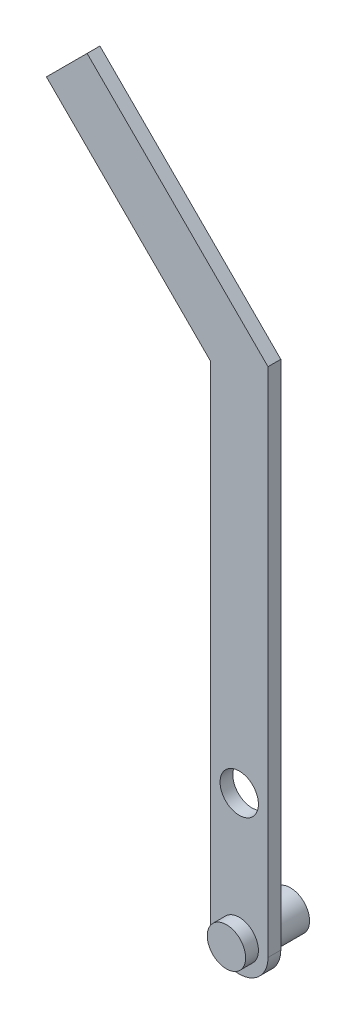
ISO-10303-21;
HEADER;
FILE_DESCRIPTION(('STEP AP214'),'2;1');
FILE_NAME('part.step','',(''),(''),'','','');
FILE_SCHEMA(('AUTOMOTIVE_DESIGN { 1 0 10303 214 1 1 1 1 }'));
ENDSEC;
DATA;
#1=APPLICATION_CONTEXT('core data for automotive mechanical design processes');
#2=APPLICATION_PROTOCOL_DEFINITION('international standard','automotive_design',2000,#1);
#3=PRODUCT_CONTEXT('',#1,'mechanical');
#4=PRODUCT('Part','Part','',(#3));
#5=PRODUCT_RELATED_PRODUCT_CATEGORY('part','',(#4));
#6=PRODUCT_DEFINITION_FORMATION('','',#4);
#7=PRODUCT_DEFINITION_CONTEXT('part definition',#1,'design');
#8=PRODUCT_DEFINITION('design','',#6,#7);
#9=PRODUCT_DEFINITION_SHAPE('','',#8);
#10=(LENGTH_UNIT() NAMED_UNIT(*) SI_UNIT(.MILLI.,.METRE.));
#11=(NAMED_UNIT(*) PLANE_ANGLE_UNIT() SI_UNIT($,.RADIAN.));
#12=(NAMED_UNIT(*) SI_UNIT($,.STERADIAN.) SOLID_ANGLE_UNIT());
#13=UNCERTAINTY_MEASURE_WITH_UNIT(LENGTH_MEASURE(1.E-05),#10,'distance_accuracy_value','');
#14=(GEOMETRIC_REPRESENTATION_CONTEXT(3) GLOBAL_UNCERTAINTY_ASSIGNED_CONTEXT((#13)) GLOBAL_UNIT_ASSIGNED_CONTEXT((#10,
#11,#12)) REPRESENTATION_CONTEXT('',''));
#15=CARTESIAN_POINT('',(0.,0.,0.));
#16=DIRECTION('',(0.,0.,1.));
#17=DIRECTION('',(1.,0.,0.));
#18=AXIS2_PLACEMENT_3D('',#15,#16,#17);
#19=CARTESIAN_POINT('',(9.84690216765042,-145.388341681108,5.10774679926043));
#20=DIRECTION('',(0.,0.,1.));
#21=DIRECTION('',(1.,0.,0.));
#22=AXIS2_PLACEMENT_3D('',#19,#20,#21);
#23=PLANE('',#22);
#24=DIRECTION('',(0.,1.,0.));
#25=VECTOR('',#24,1.);
#26=CARTESIAN_POINT('',(25.5969021676504,-145.388341681108,5.10774679926043));
#27=LINE('',#26,#25);
#28=CARTESIAN_POINT('',(25.5969021676504,-145.388341681108,5.10774679926043));
#29=VERTEX_POINT('',#28);
#30=CARTESIAN_POINT('',(25.5969021676524,134.611658318892,5.10774679926043));
#31=VERTEX_POINT('',#30);
#32=EDGE_CURVE('E152',#29,#31,#27,.T.);
#33=ORIENTED_EDGE('',*,*,#32,.T.);
#34=DIRECTION('',(-0.707106781186539,0.707106781186556,0.));
#35=VECTOR('',#34,1.);
#36=CARTESIAN_POINT('',(-73.3980471984631,233.606607685009,5.10774679926043));
#37=LINE('',#36,#35);
#38=CARTESIAN_POINT('',(-73.3980471984631,233.606607685009,5.10774679926043));
#39=VERTEX_POINT('',#38);
#40=EDGE_CURVE('E130',#31,#39,#37,.T.);
#41=ORIENTED_EDGE('',*,*,#40,.T.);
#42=DIRECTION('',(-0.707106781186561,-0.707106781186534,0.));
#43=VECTOR('',#42,1.);
#44=CARTESIAN_POINT('',(-95.6719108058409,211.332744077632,5.10774679926043));
#45=LINE('',#44,#43);
#46=CARTESIAN_POINT('',(-95.6719108058409,211.332744077632,5.10774679926043));
#47=VERTEX_POINT('',#46);
#48=EDGE_CURVE('E110',#39,#47,#45,.T.);
#49=ORIENTED_EDGE('',*,*,#48,.T.);
#50=DIRECTION('',(0.707106781186538,-0.707106781186557,0.));
#51=VECTOR('',#50,1.);
#52=CARTESIAN_POINT('',(-5.9030978323496,121.563931104139,5.10774679926043));
#53=LINE('',#52,#51);
#54=CARTESIAN_POINT('',(-5.9030978323496,121.563931104139,5.10774679926043));
#55=VERTEX_POINT('',#54);
#56=EDGE_CURVE('E125',#47,#55,#53,.T.);
#57=ORIENTED_EDGE('',*,*,#56,.T.);
#58=DIRECTION('',(0.,-1.,0.));
#59=VECTOR('',#58,1.);
#60=CARTESIAN_POINT('',(-5.90309783234957,-145.388341681108,5.10774679926043));
#61=LINE('',#60,#59);
#62=CARTESIAN_POINT('',(-5.90309783234957,-145.388341681108,5.10774679926043));
#63=VERTEX_POINT('',#62);
#64=EDGE_CURVE('E59',#55,#63,#61,.T.);
#65=ORIENTED_EDGE('',*,*,#64,.T.);
#66=CARTESIAN_POINT('',(9.84690216765042,-145.388341681108,5.10774679926043));
#67=DIRECTION('',(0.,0.,1.));
#68=DIRECTION('',(1.,0.,0.));
#69=AXIS2_PLACEMENT_3D('',#66,#67,#68);
#70=CIRCLE('',#69,15.75);
#71=EDGE_CURVE('E150',#63,#29,#70,.T.);
#72=ORIENTED_EDGE('',*,*,#71,.T.);
#73=EDGE_LOOP('',(#33,#41,#49,#57,#65,#72));
#74=FACE_BOUND('',#73,.T.);
#75=CARTESIAN_POINT('',(9.84690216765042,-144.704682065639,5.10774679926043));
#76=DIRECTION('',(0.,0.,1.));
#77=DIRECTION('',(1.,0.,0.));
#78=AXIS2_PLACEMENT_3D('',#75,#76,#77);
#79=CIRCLE('',#78,10.5);
#80=CARTESIAN_POINT('',(20.3469021676504,-144.704682065639,5.10774679926043));
#81=VERTEX_POINT('',#80);
#82=EDGE_CURVE('E11',#81,#81,#79,.T.);
#83=ORIENTED_EDGE('',*,*,#82,.F.);
#84=EDGE_LOOP('',(#83));
#85=FACE_BOUND('',#84,.T.);
#86=CARTESIAN_POINT('',(9.84690216765042,-75.3883416811084,5.10774679926043));
#87=DIRECTION('',(0.,0.,1.));
#88=DIRECTION('',(1.,0.,0.));
#89=AXIS2_PLACEMENT_3D('',#86,#87,#88);
#90=CIRCLE('',#89,10.5);
#91=CARTESIAN_POINT('',(20.3469021676504,-75.3883416811084,5.10774679926043));
#92=VERTEX_POINT('',#91);
#93=EDGE_CURVE('E143',#92,#92,#90,.T.);
#94=ORIENTED_EDGE('',*,*,#93,.F.);
#95=EDGE_LOOP('',(#94));
#96=FACE_BOUND('',#95,.T.);
#97=ADVANCED_FACE('F40',(#74,#85,#96),#23,.T.);
#98=CARTESIAN_POINT('',(9.84690216765042,-145.388341681108,-1.89225320073957));
#99=DIRECTION('',(0.,0.,1.));
#100=DIRECTION('',(1.,0.,0.));
#101=AXIS2_PLACEMENT_3D('',#98,#99,#100);
#102=PLANE('',#101);
#103=CARTESIAN_POINT('',(9.84690216765042,-144.704682065639,-1.89225320073957));
#104=DIRECTION('',(0.,0.,1.));
#105=DIRECTION('',(1.,0.,0.));
#106=AXIS2_PLACEMENT_3D('',#103,#104,#105);
#107=CIRCLE('',#106,10.5);
#108=CARTESIAN_POINT('',(20.3469021676504,-144.704682065639,-1.89225320073957));
#109=VERTEX_POINT('',#108);
#110=EDGE_CURVE('E44',#109,#109,#107,.T.);
#111=ORIENTED_EDGE('',*,*,#110,.T.);
#112=EDGE_LOOP('',(#111));
#113=FACE_BOUND('',#112,.T.);
#114=DIRECTION('',(0.,-1.,0.));
#115=VECTOR('',#114,1.);
#116=CARTESIAN_POINT('',(-5.90309783234957,-145.388341681108,-1.89225320073957));
#117=LINE('',#116,#115);
#118=CARTESIAN_POINT('',(-5.9030978323496,121.563931104139,-1.89225320073957));
#119=VERTEX_POINT('',#118);
#120=CARTESIAN_POINT('',(-5.90309783234957,-145.388341681108,-1.89225320073957));
#121=VERTEX_POINT('',#120);
#122=EDGE_CURVE('E78',#119,#121,#117,.T.);
#123=ORIENTED_EDGE('',*,*,#122,.F.);
#124=DIRECTION('',(0.707106781186538,-0.707106781186557,0.));
#125=VECTOR('',#124,1.);
#126=CARTESIAN_POINT('',(-5.9030978323496,121.563931104139,-1.89225320073957));
#127=LINE('',#126,#125);
#128=CARTESIAN_POINT('',(-95.6719108058409,211.332744077632,-1.89225320073957));
#129=VERTEX_POINT('',#128);
#130=EDGE_CURVE('E122',#129,#119,#127,.T.);
#131=ORIENTED_EDGE('',*,*,#130,.F.);
#132=DIRECTION('',(-0.707106781186561,-0.707106781186534,0.));
#133=VECTOR('',#132,1.);
#134=CARTESIAN_POINT('',(-95.6719108058409,211.332744077632,-1.89225320073957));
#135=LINE('',#134,#133);
#136=CARTESIAN_POINT('',(-73.3980471984631,233.606607685009,-1.89225320073957));
#137=VERTEX_POINT('',#136);
#138=EDGE_CURVE('E108',#137,#129,#135,.T.);
#139=ORIENTED_EDGE('',*,*,#138,.F.);
#140=DIRECTION('',(-0.707106781186539,0.707106781186556,0.));
#141=VECTOR('',#140,1.);
#142=CARTESIAN_POINT('',(-73.3980471984631,233.606607685009,-1.89225320073957));
#143=LINE('',#142,#141);
#144=CARTESIAN_POINT('',(25.5969021676524,134.611658318892,-1.89225320073957));
#145=VERTEX_POINT('',#144);
#146=EDGE_CURVE('E120',#145,#137,#143,.T.);
#147=ORIENTED_EDGE('',*,*,#146,.F.);
#148=DIRECTION('',(0.,1.,0.));
#149=VECTOR('',#148,1.);
#150=CARTESIAN_POINT('',(25.5969021676504,-145.388341681108,-1.89225320073957));
#151=LINE('',#150,#149);
#152=CARTESIAN_POINT('',(25.5969021676504,-145.388341681108,-1.89225320073957));
#153=VERTEX_POINT('',#152);
#154=EDGE_CURVE('E71',#153,#145,#151,.T.);
#155=ORIENTED_EDGE('',*,*,#154,.F.);
#156=CARTESIAN_POINT('',(9.84690216765042,-145.388341681108,-1.89225320073957));
#157=DIRECTION('',(0.,0.,1.));
#158=DIRECTION('',(1.,0.,0.));
#159=AXIS2_PLACEMENT_3D('',#156,#157,#158);
#160=CIRCLE('',#159,15.75);
#161=EDGE_CURVE('E146',#121,#153,#160,.T.);
#162=ORIENTED_EDGE('',*,*,#161,.F.);
#163=EDGE_LOOP('',(#123,#131,#139,#147,#155,#162));
#164=FACE_BOUND('',#163,.T.);
#165=CARTESIAN_POINT('',(9.84690216765042,-75.3883416811084,-1.89225320073957));
#166=DIRECTION('',(0.,0.,1.));
#167=DIRECTION('',(1.,0.,0.));
#168=AXIS2_PLACEMENT_3D('',#165,#166,#167);
#169=CIRCLE('',#168,10.5);
#170=CARTESIAN_POINT('',(20.3469021676504,-75.3883416811084,-1.89225320073957));
#171=VERTEX_POINT('',#170);
#172=EDGE_CURVE('E147',#171,#171,#169,.T.);
#173=ORIENTED_EDGE('',*,*,#172,.T.);
#174=EDGE_LOOP('',(#173));
#175=FACE_BOUND('',#174,.T.);
#176=ADVANCED_FACE('F118',(#113,#164,#175),#102,.F.);
#177=CARTESIAN_POINT('',(9.84690216765042,-145.388341681108,5.10774679926043));
#178=DIRECTION('',(0.,0.,-1.));
#179=DIRECTION('',(-1.,0.,0.));
#180=AXIS2_PLACEMENT_3D('',#177,#178,#179);
#181=CYLINDRICAL_SURFACE('',#180,15.75);
#182=ORIENTED_EDGE('',*,*,#161,.T.);
#183=DIRECTION('',(0.,0.,-1.));
#184=VECTOR('',#183,1.);
#185=CARTESIAN_POINT('',(25.5969021676504,-145.388341681108,5.10774679926043));
#186=LINE('',#185,#184);
#187=EDGE_CURVE('E50',#29,#153,#186,.T.);
#188=ORIENTED_EDGE('',*,*,#187,.F.);
#189=ORIENTED_EDGE('',*,*,#71,.F.);
#190=DIRECTION('',(0.,0.,-1.));
#191=VECTOR('',#190,1.);
#192=CARTESIAN_POINT('',(-5.90309783234957,-145.388341681108,5.10774679926043));
#193=LINE('',#192,#191);
#194=EDGE_CURVE('E155',#63,#121,#193,.T.);
#195=ORIENTED_EDGE('',*,*,#194,.T.);
#196=EDGE_LOOP('',(#182,#188,#189,#195));
#197=FACE_BOUND('',#196,.T.);
#198=ADVANCED_FACE('F42',(#197),#181,.T.);
#199=CARTESIAN_POINT('',(25.5969021676504,-145.388341681108,5.10774679926043));
#200=DIRECTION('',(-1.,0.,0.));
#201=DIRECTION('',(0.,-1.,0.));
#202=AXIS2_PLACEMENT_3D('',#199,#200,#201);
#203=PLANE('',#202);
#204=ORIENTED_EDGE('',*,*,#154,.T.);
#205=DIRECTION('',(0.,0.,1.));
#206=VECTOR('',#205,1.);
#207=CARTESIAN_POINT('',(25.5969021676524,134.611658318892,-1.89225320073957));
#208=LINE('',#207,#206);
#209=EDGE_CURVE('E116',#145,#31,#208,.T.);
#210=ORIENTED_EDGE('',*,*,#209,.T.);
#211=ORIENTED_EDGE('',*,*,#32,.F.);
#212=ORIENTED_EDGE('',*,*,#187,.T.);
#213=EDGE_LOOP('',(#204,#210,#211,#212));
#214=FACE_BOUND('',#213,.T.);
#215=ADVANCED_FACE('F162',(#214),#203,.F.);
#216=CARTESIAN_POINT('',(-5.90309783234957,-145.388341681108,5.10774679926043));
#217=DIRECTION('',(1.,0.,0.));
#218=DIRECTION('',(0.,1.,0.));
#219=AXIS2_PLACEMENT_3D('',#216,#217,#218);
#220=PLANE('',#219);
#221=ORIENTED_EDGE('',*,*,#122,.T.);
#222=ORIENTED_EDGE('',*,*,#194,.F.);
#223=ORIENTED_EDGE('',*,*,#64,.F.);
#224=DIRECTION('',(0.,0.,1.));
#225=VECTOR('',#224,1.);
#226=CARTESIAN_POINT('',(-5.9030978323496,121.563931104139,-1.89225320073957));
#227=LINE('',#226,#225);
#228=EDGE_CURVE('E133',#119,#55,#227,.T.);
#229=ORIENTED_EDGE('',*,*,#228,.F.);
#230=EDGE_LOOP('',(#221,#222,#223,#229));
#231=FACE_BOUND('',#230,.T.);
#232=ADVANCED_FACE('F165',(#231),#220,.F.);
#233=CARTESIAN_POINT('',(9.84690216765042,-75.3883416811084,5.10774679926043));
#234=DIRECTION('',(0.,0.,-1.));
#235=DIRECTION('',(-1.,0.,0.));
#236=AXIS2_PLACEMENT_3D('',#233,#234,#235);
#237=CYLINDRICAL_SURFACE('',#236,10.5);
#238=ORIENTED_EDGE('',*,*,#93,.T.);
#239=EDGE_LOOP('',(#238));
#240=FACE_BOUND('',#239,.T.);
#241=ORIENTED_EDGE('',*,*,#172,.F.);
#242=EDGE_LOOP('',(#241));
#243=FACE_BOUND('',#242,.T.);
#244=ADVANCED_FACE('F176',(#240,#243),#237,.F.);
#245=CARTESIAN_POINT('',(9.84690216765042,-144.704682065639,-22.8922532007396));
#246=DIRECTION('',(0.,0.,1.));
#247=DIRECTION('',(1.,0.,0.));
#248=AXIS2_PLACEMENT_3D('',#245,#246,#247);
#249=PLANE('',#248);
#250=CARTESIAN_POINT('',(9.84690216765042,-144.704682065639,-22.8922532007396));
#251=DIRECTION('',(0.,0.,1.));
#252=DIRECTION('',(1.,0.,0.));
#253=AXIS2_PLACEMENT_3D('',#250,#251,#252);
#254=CIRCLE('',#253,10.5);
#255=CARTESIAN_POINT('',(20.3469021676504,-144.704682065639,-22.8922532007396));
#256=VERTEX_POINT('',#255);
#257=EDGE_CURVE('E140',#256,#256,#254,.T.);
#258=ORIENTED_EDGE('',*,*,#257,.F.);
#259=EDGE_LOOP('',(#258));
#260=FACE_BOUND('',#259,.T.);
#261=ADVANCED_FACE('F179',(#260),#249,.F.);
#262=CARTESIAN_POINT('',(9.84690216765042,-144.704682065639,-22.8922532007396));
#263=DIRECTION('',(0.,0.,1.));
#264=DIRECTION('',(1.,0.,0.));
#265=AXIS2_PLACEMENT_3D('',#262,#263,#264);
#266=CYLINDRICAL_SURFACE('',#265,10.5);
#267=ORIENTED_EDGE('',*,*,#257,.T.);
#268=EDGE_LOOP('',(#267));
#269=FACE_BOUND('',#268,.T.);
#270=ORIENTED_EDGE('',*,*,#110,.F.);
#271=EDGE_LOOP('',(#270));
#272=FACE_BOUND('',#271,.T.);
#273=ADVANCED_FACE('F210',(#269,#272),#266,.T.);
#274=ORIENTED_EDGE('',*,*,#82,.T.);
#275=EDGE_LOOP('',(#274));
#276=FACE_BOUND('',#275,.T.);
#277=CARTESIAN_POINT('',(9.84690216765042,-144.704682065639,12.1077467992604));
#278=DIRECTION('',(0.,0.,1.));
#279=DIRECTION('',(1.,0.,0.));
#280=AXIS2_PLACEMENT_3D('',#277,#278,#279);
#281=CIRCLE('',#280,10.5);
#282=CARTESIAN_POINT('',(20.3469021676504,-144.704682065639,12.1077467992604));
#283=VERTEX_POINT('',#282);
#284=EDGE_CURVE('E135',#283,#283,#281,.T.);
#285=ORIENTED_EDGE('',*,*,#284,.F.);
#286=EDGE_LOOP('',(#285));
#287=FACE_BOUND('',#286,.T.);
#288=ADVANCED_FACE('F218',(#276,#287),#266,.T.);
#289=CARTESIAN_POINT('',(9.84690216765042,-144.704682065639,12.1077467992604));
#290=DIRECTION('',(0.,0.,1.));
#291=DIRECTION('',(1.,0.,0.));
#292=AXIS2_PLACEMENT_3D('',#289,#290,#291);
#293=PLANE('',#292);
#294=ORIENTED_EDGE('',*,*,#284,.T.);
#295=EDGE_LOOP('',(#294));
#296=FACE_BOUND('',#295,.T.);
#297=ADVANCED_FACE('F226',(#296),#293,.T.);
#298=CARTESIAN_POINT('',(-5.9030978323496,121.563931104139,-1.89225320073957));
#299=DIRECTION('',(-0.707106781186557,-0.707106781186538,0.));
#300=DIRECTION('',(0.707106781186538,-0.707106781186557,0.));
#301=AXIS2_PLACEMENT_3D('',#298,#299,#300);
#302=PLANE('',#301);
#303=ORIENTED_EDGE('',*,*,#56,.F.);
#304=DIRECTION('',(0.,0.,1.));
#305=VECTOR('',#304,1.);
#306=CARTESIAN_POINT('',(-95.6719108058409,211.332744077632,-1.89225320073957));
#307=LINE('',#306,#305);
#308=EDGE_CURVE('E115',#129,#47,#307,.T.);
#309=ORIENTED_EDGE('',*,*,#308,.F.);
#310=ORIENTED_EDGE('',*,*,#130,.T.);
#311=ORIENTED_EDGE('',*,*,#228,.T.);
#312=EDGE_LOOP('',(#303,#309,#310,#311));
#313=FACE_BOUND('',#312,.T.);
#314=ADVANCED_FACE('F168',(#313),#302,.T.);
#315=CARTESIAN_POINT('',(-95.6719108058409,211.332744077632,-1.89225320073957));
#316=DIRECTION('',(-0.707106781186534,0.707106781186561,0.));
#317=DIRECTION('',(-0.707106781186561,-0.707106781186534,0.));
#318=AXIS2_PLACEMENT_3D('',#315,#316,#317);
#319=PLANE('',#318);
#320=ORIENTED_EDGE('',*,*,#48,.F.);
#321=DIRECTION('',(0.,0.,1.));
#322=VECTOR('',#321,1.);
#323=CARTESIAN_POINT('',(-73.3980471984631,233.606607685009,-1.89225320073957));
#324=LINE('',#323,#322);
#325=EDGE_CURVE('E105',#137,#39,#324,.T.);
#326=ORIENTED_EDGE('',*,*,#325,.F.);
#327=ORIENTED_EDGE('',*,*,#138,.T.);
#328=ORIENTED_EDGE('',*,*,#308,.T.);
#329=EDGE_LOOP('',(#320,#326,#327,#328));
#330=FACE_BOUND('',#329,.T.);
#331=ADVANCED_FACE('F107',(#330),#319,.T.);
#332=CARTESIAN_POINT('',(-73.3980471984631,233.606607685009,-1.89225320073957));
#333=DIRECTION('',(0.707106781186556,0.707106781186539,0.));
#334=DIRECTION('',(-0.707106781186539,0.707106781186556,0.));
#335=AXIS2_PLACEMENT_3D('',#332,#333,#334);
#336=PLANE('',#335);
#337=ORIENTED_EDGE('',*,*,#40,.F.);
#338=ORIENTED_EDGE('',*,*,#209,.F.);
#339=ORIENTED_EDGE('',*,*,#146,.T.);
#340=ORIENTED_EDGE('',*,*,#325,.T.);
#341=EDGE_LOOP('',(#337,#338,#339,#340));
#342=FACE_BOUND('',#341,.T.);
#343=ADVANCED_FACE('F124',(#342),#336,.T.);
#344=CLOSED_SHELL('',(#97,#176,#198,#215,#232,#244,#261,#273,#288,#297,#314,#331,#343));
#345=MANIFOLD_SOLID_BREP('B2',#344);
#346=ADVANCED_BREP_SHAPE_REPRESENTATION('',(#18,#345),#14);
#347=SHAPE_DEFINITION_REPRESENTATION(#9,#346);
ENDSEC;
END-ISO-10303-21;
